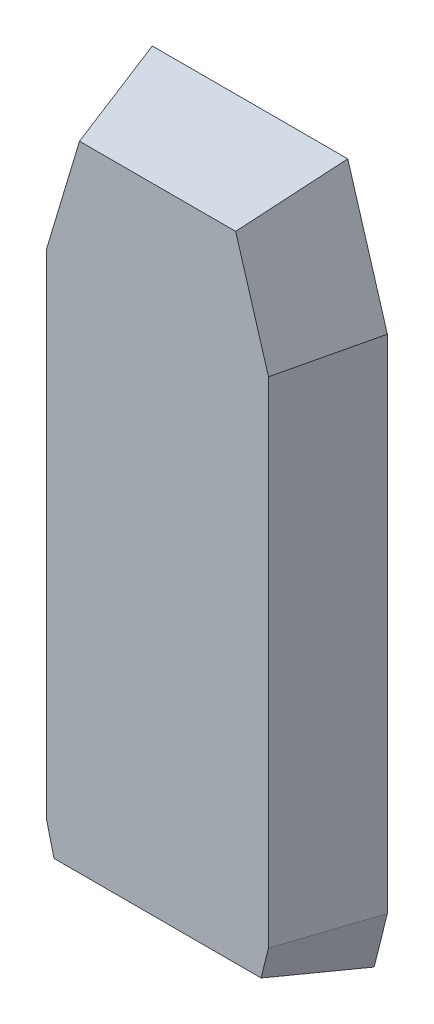
ISO-10303-21;
HEADER;
FILE_DESCRIPTION(('STEP AP214'),'2;1');
FILE_NAME('part.step','',(''),(''),'','','');
FILE_SCHEMA(('AUTOMOTIVE_DESIGN { 1 0 10303 214 1 1 1 1 }'));
ENDSEC;
DATA;
#1=APPLICATION_CONTEXT('core data for automotive mechanical design processes');
#2=APPLICATION_PROTOCOL_DEFINITION('international standard','automotive_design',2000,#1);
#3=PRODUCT_CONTEXT('',#1,'mechanical');
#4=PRODUCT('Part','Part','',(#3));
#5=PRODUCT_RELATED_PRODUCT_CATEGORY('part','',(#4));
#6=PRODUCT_DEFINITION_FORMATION('','',#4);
#7=PRODUCT_DEFINITION_CONTEXT('part definition',#1,'design');
#8=PRODUCT_DEFINITION('design','',#6,#7);
#9=PRODUCT_DEFINITION_SHAPE('','',#8);
#10=(LENGTH_UNIT() NAMED_UNIT(*) SI_UNIT(.MILLI.,.METRE.));
#11=(NAMED_UNIT(*) PLANE_ANGLE_UNIT() SI_UNIT($,.RADIAN.));
#12=(NAMED_UNIT(*) SI_UNIT($,.STERADIAN.) SOLID_ANGLE_UNIT());
#13=UNCERTAINTY_MEASURE_WITH_UNIT(LENGTH_MEASURE(1.E-05),#10,'distance_accuracy_value','');
#14=(GEOMETRIC_REPRESENTATION_CONTEXT(3) GLOBAL_UNCERTAINTY_ASSIGNED_CONTEXT((#13)) GLOBAL_UNIT_ASSIGNED_CONTEXT((#10,
#11,#12)) REPRESENTATION_CONTEXT('',''));
#15=CARTESIAN_POINT('',(0.,0.,0.));
#16=DIRECTION('',(0.,0.,1.));
#17=DIRECTION('',(1.,0.,0.));
#18=AXIS2_PLACEMENT_3D('',#15,#16,#17);
#19=CARTESIAN_POINT('',(0.,0.,70.));
#20=DIRECTION('',(0.,0.,1.));
#21=DIRECTION('',(1.,0.,0.));
#22=AXIS2_PLACEMENT_3D('',#19,#20,#21);
#23=PLANE('',#22);
#24=DIRECTION('',(0.242535625036335,0.970142500145332,0.));
#25=VECTOR('',#24,1.);
#26=CARTESIAN_POINT('',(39.1922359359559,-105.,70.));
#27=LINE('',#26,#25);
#28=CARTESIAN_POINT('',(39.1922359359559,-105.,70.));
#29=VERTEX_POINT('',#28);
#30=CARTESIAN_POINT('',(42.,-93.7689437438237,70.));
#31=VERTEX_POINT('',#30);
#32=EDGE_CURVE('E366',#29,#31,#27,.T.);
#33=ORIENTED_EDGE('',*,*,#32,.T.);
#34=DIRECTION('',(0.,1.,0.));
#35=VECTOR('',#34,1.);
#36=CARTESIAN_POINT('',(42.,-93.7689437438237,70.));
#37=LINE('',#36,#35);
#38=CARTESIAN_POINT('',(42.,93.5323116369648,70.));
#39=VERTEX_POINT('',#38);
#40=EDGE_CURVE('E523',#31,#39,#37,.T.);
#41=ORIENTED_EDGE('',*,*,#40,.T.);
#42=DIRECTION('',(-0.287347885566345,0.957826285221151,0.));
#43=VECTOR('',#42,1.);
#44=CARTESIAN_POINT('',(42.,93.5323116369648,70.));
#45=LINE('',#44,#43);
#46=CARTESIAN_POINT('',(29.5596934910895,135.,70.));
#47=VERTEX_POINT('',#46);
#48=EDGE_CURVE('E518',#39,#47,#45,.T.);
#49=ORIENTED_EDGE('',*,*,#48,.T.);
#50=DIRECTION('',(-1.,0.,0.));
#51=VECTOR('',#50,1.);
#52=CARTESIAN_POINT('',(29.5596934910895,135.,70.));
#53=LINE('',#52,#51);
#54=CARTESIAN_POINT('',(-29.5596934910895,135.,70.));
#55=VERTEX_POINT('',#54);
#56=EDGE_CURVE('E522',#47,#55,#53,.T.);
#57=ORIENTED_EDGE('',*,*,#56,.T.);
#58=DIRECTION('',(-0.287347885566346,-0.957826285221151,0.));
#59=VECTOR('',#58,1.);
#60=CARTESIAN_POINT('',(-29.5596934910895,135.,70.));
#61=LINE('',#60,#59);
#62=CARTESIAN_POINT('',(-41.9999999999999,93.5323116369651,70.));
#63=VERTEX_POINT('',#62);
#64=EDGE_CURVE('E643',#55,#63,#61,.T.);
#65=ORIENTED_EDGE('',*,*,#64,.T.);
#66=DIRECTION('',(0.,-1.,0.));
#67=VECTOR('',#66,1.);
#68=CARTESIAN_POINT('',(-41.9999999999999,93.5323116369651,70.));
#69=LINE('',#68,#67);
#70=CARTESIAN_POINT('',(-42.,-93.7689437438234,70.));
#71=VERTEX_POINT('',#70);
#72=EDGE_CURVE('E595',#63,#71,#69,.T.);
#73=ORIENTED_EDGE('',*,*,#72,.T.);
#74=DIRECTION('',(0.242535625036332,-0.970142500145332,0.));
#75=VECTOR('',#74,1.);
#76=CARTESIAN_POINT('',(-42.,-93.7689437438234,70.));
#77=LINE('',#76,#75);
#78=CARTESIAN_POINT('',(-39.1922359359558,-105.,70.));
#79=VERTEX_POINT('',#78);
#80=EDGE_CURVE('E149',#71,#79,#77,.T.);
#81=ORIENTED_EDGE('',*,*,#80,.T.);
#82=DIRECTION('',(1.,0.,0.));
#83=VECTOR('',#82,1.);
#84=CARTESIAN_POINT('',(-39.1922359359558,-105.,70.));
#85=LINE('',#84,#83);
#86=EDGE_CURVE('E13',#79,#29,#85,.T.);
#87=ORIENTED_EDGE('',*,*,#86,.T.);
#88=EDGE_LOOP('',(#33,#41,#49,#57,#65,#73,#81,#87));
#89=FACE_BOUND('',#88,.T.);
#90=ADVANCED_FACE('F138',(#89),#23,.T.);
#91=CARTESIAN_POINT('',(0.,0.,35.));
#92=DIRECTION('',(0.,0.,1.));
#93=DIRECTION('',(1.,0.,0.));
#94=AXIS2_PLACEMENT_3D('',#91,#92,#93);
#95=PLANE('',#94);
#96=DIRECTION('',(-0.287347885566345,0.957826285221151,0.));
#97=VECTOR('',#96,1.);
#98=CARTESIAN_POINT('',(70.8647478900666,21.25942436702,35.));
#99=LINE('',#98,#97);
#100=CARTESIAN_POINT('',(48.8799529045941,94.5420743185951,35.));
#101=VERTEX_POINT('',#100);
#102=CARTESIAN_POINT('',(34.6785893287944,141.879952904594,35.));
#103=VERTEX_POINT('',#102);
#104=EDGE_CURVE('E325',#101,#103,#99,.T.);
#105=ORIENTED_EDGE('',*,*,#104,.T.);
#106=DIRECTION('',(-1.,0.,0.));
#107=VECTOR('',#106,1.);
#108=CARTESIAN_POINT('',(0.,141.879952904594,35.));
#109=LINE('',#108,#107);
#110=CARTESIAN_POINT('',(-34.6785893287944,141.879952904594,35.));
#111=VERTEX_POINT('',#110);
#112=EDGE_CURVE('E322',#103,#111,#109,.T.);
#113=ORIENTED_EDGE('',*,*,#112,.T.);
#114=DIRECTION('',(-0.287347885566346,-0.957826285221151,0.));
#115=VECTOR('',#114,1.);
#116=CARTESIAN_POINT('',(-70.8647478900667,21.25942436702,35.));
#117=LINE('',#116,#115);
#118=CARTESIAN_POINT('',(-48.879952904594,94.5420743185954,35.));
#119=VERTEX_POINT('',#118);
#120=EDGE_CURVE('E314',#111,#119,#117,.T.);
#121=ORIENTED_EDGE('',*,*,#120,.T.);
#122=DIRECTION('',(0.,-1.,0.));
#123=VECTOR('',#122,1.);
#124=CARTESIAN_POINT('',(-48.879952904594,0.,35.));
#125=LINE('',#124,#123);
#126=CARTESIAN_POINT('',(-48.879952904594,-94.6159046503635,35.));
#127=VERTEX_POINT('',#126);
#128=EDGE_CURVE('E157',#119,#127,#125,.T.);
#129=ORIENTED_EDGE('',*,*,#128,.T.);
#130=DIRECTION('',(0.242535625036332,-0.970142500145332,0.));
#131=VECTOR('',#130,1.);
#132=CARTESIAN_POINT('',(-68.2672273573504,-17.0668068393375,35.));
#133=LINE('',#132,#131);
#134=CARTESIAN_POINT('',(-44.5639408410364,-111.879952904594,35.));
#135=VERTEX_POINT('',#134);
#136=EDGE_CURVE('E315',#127,#135,#133,.T.);
#137=ORIENTED_EDGE('',*,*,#136,.T.);
#138=DIRECTION('',(1.,0.,0.));
#139=VECTOR('',#138,1.);
#140=CARTESIAN_POINT('',(0.,-111.879952904594,35.));
#141=LINE('',#140,#139);
#142=CARTESIAN_POINT('',(44.5639408410364,-111.879952904594,35.));
#143=VERTEX_POINT('',#142);
#144=EDGE_CURVE('E318',#135,#143,#141,.T.);
#145=ORIENTED_EDGE('',*,*,#144,.T.);
#146=DIRECTION('',(0.242535625036335,0.970142500145331,0.));
#147=VECTOR('',#146,1.);
#148=CARTESIAN_POINT('',(68.2672273573507,-17.0668068393378,35.));
#149=LINE('',#148,#147);
#150=CARTESIAN_POINT('',(48.879952904594,-94.6159046503638,35.));
#151=VERTEX_POINT('',#150);
#152=EDGE_CURVE('E329',#143,#151,#149,.T.);
#153=ORIENTED_EDGE('',*,*,#152,.T.);
#154=DIRECTION('',(0.,1.,0.));
#155=VECTOR('',#154,1.);
#156=CARTESIAN_POINT('',(48.879952904594,0.,35.));
#157=LINE('',#156,#155);
#158=EDGE_CURVE('E273',#151,#101,#157,.T.);
#159=ORIENTED_EDGE('',*,*,#158,.T.);
#160=EDGE_LOOP('',(#105,#113,#121,#129,#137,#145,#153,#159));
#161=FACE_BOUND('',#160,.T.);
#162=DIRECTION('',(-1.,0.,0.));
#163=VECTOR('',#162,1.);
#164=CARTESIAN_POINT('',(-37.,145.,35.));
#165=LINE('',#164,#163);
#166=CARTESIAN_POINT('',(37.,145.,35.));
#167=VERTEX_POINT('',#166);
#168=CARTESIAN_POINT('',(-37.,145.,35.));
#169=VERTEX_POINT('',#168);
#170=EDGE_CURVE('E300',#167,#169,#165,.T.);
#171=ORIENTED_EDGE('',*,*,#170,.F.);
#172=DIRECTION('',(-0.287347885566345,0.957826285221151,0.));
#173=VECTOR('',#172,1.);
#174=CARTESIAN_POINT('',(37.,145.,35.));
#175=LINE('',#174,#173);
#176=CARTESIAN_POINT('',(52.,95.,35.));
#177=VERTEX_POINT('',#176);
#178=EDGE_CURVE('E488',#177,#167,#175,.T.);
#179=ORIENTED_EDGE('',*,*,#178,.F.);
#180=DIRECTION('',(0.,1.,0.));
#181=VECTOR('',#180,1.);
#182=CARTESIAN_POINT('',(52.,-95.0000000000003,35.));
#183=LINE('',#182,#181);
#184=CARTESIAN_POINT('',(52.,-95.0000000000003,35.));
#185=VERTEX_POINT('',#184);
#186=EDGE_CURVE('E495',#185,#177,#183,.T.);
#187=ORIENTED_EDGE('',*,*,#186,.F.);
#188=DIRECTION('',(0.242535625036335,0.970142500145331,0.));
#189=VECTOR('',#188,1.);
#190=CARTESIAN_POINT('',(52.,-95.0000000000003,35.));
#191=LINE('',#190,#189);
#192=CARTESIAN_POINT('',(47.,-115.,35.));
#193=VERTEX_POINT('',#192);
#194=EDGE_CURVE('E499',#193,#185,#191,.T.);
#195=ORIENTED_EDGE('',*,*,#194,.F.);
#196=DIRECTION('',(1.,0.,0.));
#197=VECTOR('',#196,1.);
#198=CARTESIAN_POINT('',(47.,-115.,35.));
#199=LINE('',#198,#197);
#200=CARTESIAN_POINT('',(-47.,-115.,35.));
#201=VERTEX_POINT('',#200);
#202=EDGE_CURVE('E584',#201,#193,#199,.T.);
#203=ORIENTED_EDGE('',*,*,#202,.F.);
#204=DIRECTION('',(0.242535625036332,-0.970142500145332,0.));
#205=VECTOR('',#204,1.);
#206=CARTESIAN_POINT('',(-47.,-115.,35.));
#207=LINE('',#206,#205);
#208=CARTESIAN_POINT('',(-52.,-95.,35.));
#209=VERTEX_POINT('',#208);
#210=EDGE_CURVE('E738',#209,#201,#207,.T.);
#211=ORIENTED_EDGE('',*,*,#210,.F.);
#212=DIRECTION('',(0.,-1.,0.));
#213=VECTOR('',#212,1.);
#214=CARTESIAN_POINT('',(-52.,-95.,35.));
#215=LINE('',#214,#213);
#216=CARTESIAN_POINT('',(-51.9999999999999,95.0000000000003,35.));
#217=VERTEX_POINT('',#216);
#218=EDGE_CURVE('E422',#217,#209,#215,.T.);
#219=ORIENTED_EDGE('',*,*,#218,.F.);
#220=DIRECTION('',(-0.287347885566346,-0.957826285221151,0.));
#221=VECTOR('',#220,1.);
#222=CARTESIAN_POINT('',(-51.9999999999999,95.0000000000003,35.));
#223=LINE('',#222,#221);
#224=EDGE_CURVE('E378',#169,#217,#223,.T.);
#225=ORIENTED_EDGE('',*,*,#224,.F.);
#226=EDGE_LOOP('',(#171,#179,#187,#195,#203,#211,#219,#225));
#227=FACE_BOUND('',#226,.T.);
#228=ADVANCED_FACE('F434',(#161,#227),#95,.F.);
#229=CARTESIAN_POINT('',(-52.,-95.,35.));
#230=DIRECTION('',(-0.932815246513878,-0.233203811628468,0.274721127897378));
#231=DIRECTION('',(0.242535625036332,-0.970142500145332,0.));
#232=AXIS2_PLACEMENT_3D('',#229,#230,#231);
#233=PLANE('',#232);
#234=ORIENTED_EDGE('',*,*,#210,.T.);
#235=CARTESIAN_POINT('',(-47.,-115.,35.));
#236=CARTESIAN_POINT('',(-44.397411978652,-111.666666666667,46.6666666666667));
#237=CARTESIAN_POINT('',(-41.7948239573039,-108.333333333333,58.3333333333333));
#238=CARTESIAN_POINT('',(-39.1922359359558,-105.,70.));
#239=B_SPLINE_CURVE_WITH_KNOTS('',3,(#235,#236,#237,#238),.UNSPECIFIED.,.F.,.F.,(4,4),(0.,1.),.UNSPECIFIED.);
#240=EDGE_CURVE('E357',#201,#79,#239,.T.);
#241=ORIENTED_EDGE('',*,*,#240,.T.);
#242=ORIENTED_EDGE('',*,*,#80,.F.);
#243=CARTESIAN_POINT('',(-52.,-95.,35.));
#244=CARTESIAN_POINT('',(-48.6666666666666,-94.5896479146078,46.6666666666667));
#245=CARTESIAN_POINT('',(-45.3333333333333,-94.1792958292156,58.3333333333333));
#246=CARTESIAN_POINT('',(-42.,-93.7689437438234,70.));
#247=B_SPLINE_CURVE_WITH_KNOTS('',3,(#243,#244,#245,#246),.UNSPECIFIED.,.F.,.F.,(4,4),(0.,1.),.UNSPECIFIED.);
#248=EDGE_CURVE('E347',#209,#71,#247,.T.);
#249=ORIENTED_EDGE('',*,*,#248,.F.);
#250=EDGE_LOOP('',(#234,#241,#242,#249));
#251=FACE_BOUND('',#250,.T.);
#252=ADVANCED_FACE('F444',(#251),#233,.T.);
#253=CARTESIAN_POINT('',(-51.9999999999999,95.0000000000003,35.));
#254=DIRECTION('',(-0.961523947640823,0.,0.274721127897378));
#255=DIRECTION('',(0.,-1.,0.));
#256=AXIS2_PLACEMENT_3D('',#253,#254,#255);
#257=PLANE('',#256);
#258=ORIENTED_EDGE('',*,*,#218,.T.);
#259=ORIENTED_EDGE('',*,*,#248,.T.);
#260=ORIENTED_EDGE('',*,*,#72,.F.);
#261=CARTESIAN_POINT('',(-51.9999999999999,95.0000000000003,35.));
#262=CARTESIAN_POINT('',(-48.6666666666666,94.5107705456552,46.6666666666667));
#263=CARTESIAN_POINT('',(-45.3333333333333,94.0215410913102,58.3333333333333));
#264=CARTESIAN_POINT('',(-41.9999999999999,93.5323116369651,70.));
#265=B_SPLINE_CURVE_WITH_KNOTS('',3,(#261,#262,#263,#264),.UNSPECIFIED.,.F.,.F.,(4,4),(0.,1.),.UNSPECIFIED.);
#266=EDGE_CURVE('E336',#217,#63,#265,.T.);
#267=ORIENTED_EDGE('',*,*,#266,.F.);
#268=EDGE_LOOP('',(#258,#259,#260,#267));
#269=FACE_BOUND('',#268,.T.);
#270=ADVANCED_FACE('F687',(#269),#257,.T.);
#271=CARTESIAN_POINT('',(-37.,145.,35.));
#272=DIRECTION('',(-0.920972910919986,0.276291873275996,0.274721127897378));
#273=DIRECTION('',(-0.287347885566346,-0.957826285221151,0.));
#274=AXIS2_PLACEMENT_3D('',#271,#272,#273);
#275=PLANE('',#274);
#276=ORIENTED_EDGE('',*,*,#224,.T.);
#277=ORIENTED_EDGE('',*,*,#266,.T.);
#278=ORIENTED_EDGE('',*,*,#64,.F.);
#279=CARTESIAN_POINT('',(-37.,145.,35.));
#280=CARTESIAN_POINT('',(-34.5198978303632,141.666666666667,46.6666666666667));
#281=CARTESIAN_POINT('',(-32.0397956607263,138.333333333333,58.3333333333333));
#282=CARTESIAN_POINT('',(-29.5596934910895,135.,70.));
#283=B_SPLINE_CURVE_WITH_KNOTS('',3,(#279,#280,#281,#282),.UNSPECIFIED.,.F.,.F.,(4,4),(0.,1.),.UNSPECIFIED.);
#284=EDGE_CURVE('E333',#169,#55,#283,.T.);
#285=ORIENTED_EDGE('',*,*,#284,.F.);
#286=EDGE_LOOP('',(#276,#277,#278,#285));
#287=FACE_BOUND('',#286,.T.);
#288=ADVANCED_FACE('F678',(#287),#275,.T.);
#289=CARTESIAN_POINT('',(37.,145.,35.));
#290=DIRECTION('',(0.,0.961523947640823,0.274721127897378));
#291=DIRECTION('',(-1.,0.,0.));
#292=AXIS2_PLACEMENT_3D('',#289,#290,#291);
#293=PLANE('',#292);
#294=ORIENTED_EDGE('',*,*,#170,.T.);
#295=ORIENTED_EDGE('',*,*,#284,.T.);
#296=ORIENTED_EDGE('',*,*,#56,.F.);
#297=CARTESIAN_POINT('',(37.,145.,35.));
#298=CARTESIAN_POINT('',(34.5198978303632,141.666666666667,46.6666666666667));
#299=CARTESIAN_POINT('',(32.0397956607263,138.333333333333,58.3333333333333));
#300=CARTESIAN_POINT('',(29.5596934910895,135.,70.));
#301=B_SPLINE_CURVE_WITH_KNOTS('',3,(#297,#298,#299,#300),.UNSPECIFIED.,.F.,.F.,(4,4),(0.,1.),.UNSPECIFIED.);
#302=EDGE_CURVE('E337',#167,#47,#301,.T.);
#303=ORIENTED_EDGE('',*,*,#302,.F.);
#304=EDGE_LOOP('',(#294,#295,#296,#303));
#305=FACE_BOUND('',#304,.T.);
#306=ADVANCED_FACE('F540',(#305),#293,.T.);
#307=CARTESIAN_POINT('',(52.,95.,35.));
#308=DIRECTION('',(0.920972910919987,0.276291873275996,0.274721127897378));
#309=DIRECTION('',(-0.287347885566345,0.957826285221152,0.));
#310=AXIS2_PLACEMENT_3D('',#307,#308,#309);
#311=PLANE('',#310);
#312=ORIENTED_EDGE('',*,*,#178,.T.);
#313=ORIENTED_EDGE('',*,*,#302,.T.);
#314=ORIENTED_EDGE('',*,*,#48,.F.);
#315=CARTESIAN_POINT('',(52.,95.,35.));
#316=CARTESIAN_POINT('',(48.6666666666667,94.510770545655,46.6666666666667));
#317=CARTESIAN_POINT('',(45.3333333333333,94.0215410913099,58.3333333333333));
#318=CARTESIAN_POINT('',(42.,93.5323116369648,70.));
#319=B_SPLINE_CURVE_WITH_KNOTS('',3,(#315,#316,#317,#318),.UNSPECIFIED.,.F.,.F.,(4,4),(0.,1.),.UNSPECIFIED.);
#320=EDGE_CURVE('E388',#177,#39,#319,.T.);
#321=ORIENTED_EDGE('',*,*,#320,.F.);
#322=EDGE_LOOP('',(#312,#313,#314,#321));
#323=FACE_BOUND('',#322,.T.);
#324=ADVANCED_FACE('F514',(#323),#311,.T.);
#325=CARTESIAN_POINT('',(52.,-95.0000000000003,35.));
#326=DIRECTION('',(0.961523947640823,0.,0.274721127897378));
#327=DIRECTION('',(0.,1.,0.));
#328=AXIS2_PLACEMENT_3D('',#325,#326,#327);
#329=PLANE('',#328);
#330=ORIENTED_EDGE('',*,*,#186,.T.);
#331=ORIENTED_EDGE('',*,*,#320,.T.);
#332=ORIENTED_EDGE('',*,*,#40,.F.);
#333=CARTESIAN_POINT('',(52.,-95.0000000000003,35.));
#334=CARTESIAN_POINT('',(48.6666666666666,-94.5896479146081,46.6666666666667));
#335=CARTESIAN_POINT('',(45.3333333333333,-94.1792958292159,58.3333333333333));
#336=CARTESIAN_POINT('',(42.,-93.7689437438237,70.));
#337=B_SPLINE_CURVE_WITH_KNOTS('',3,(#333,#334,#335,#336),.UNSPECIFIED.,.F.,.F.,(4,4),(0.,1.),.UNSPECIFIED.);
#338=EDGE_CURVE('E377',#185,#31,#337,.T.);
#339=ORIENTED_EDGE('',*,*,#338,.F.);
#340=EDGE_LOOP('',(#330,#331,#332,#339));
#341=FACE_BOUND('',#340,.T.);
#342=ADVANCED_FACE('F509',(#341),#329,.T.);
#343=CARTESIAN_POINT('',(47.,-115.,35.));
#344=DIRECTION('',(0.932815246513877,-0.233203811628471,0.274721127897378));
#345=DIRECTION('',(0.242535625036335,0.970142500145331,0.));
#346=AXIS2_PLACEMENT_3D('',#343,#344,#345);
#347=PLANE('',#346);
#348=ORIENTED_EDGE('',*,*,#194,.T.);
#349=ORIENTED_EDGE('',*,*,#338,.T.);
#350=ORIENTED_EDGE('',*,*,#32,.F.);
#351=CARTESIAN_POINT('',(47.,-115.,35.));
#352=CARTESIAN_POINT('',(44.397411978652,-111.666666666667,46.6666666666667));
#353=CARTESIAN_POINT('',(41.7948239573039,-108.333333333333,58.3333333333333));
#354=CARTESIAN_POINT('',(39.1922359359559,-105.,70.));
#355=B_SPLINE_CURVE_WITH_KNOTS('',3,(#351,#352,#353,#354),.UNSPECIFIED.,.F.,.F.,(4,4),(0.,1.),.UNSPECIFIED.);
#356=EDGE_CURVE('E371',#193,#29,#355,.T.);
#357=ORIENTED_EDGE('',*,*,#356,.F.);
#358=EDGE_LOOP('',(#348,#349,#350,#357));
#359=FACE_BOUND('',#358,.T.);
#360=ADVANCED_FACE('F546',(#359),#347,.T.);
#361=CARTESIAN_POINT('',(-47.,-115.,35.));
#362=DIRECTION('',(0.,-0.961523947640823,0.274721127897378));
#363=DIRECTION('',(1.,0.,0.));
#364=AXIS2_PLACEMENT_3D('',#361,#362,#363);
#365=PLANE('',#364);
#366=ORIENTED_EDGE('',*,*,#202,.T.);
#367=ORIENTED_EDGE('',*,*,#356,.T.);
#368=ORIENTED_EDGE('',*,*,#86,.F.);
#369=ORIENTED_EDGE('',*,*,#240,.F.);
#370=EDGE_LOOP('',(#366,#367,#368,#369));
#371=FACE_BOUND('',#370,.T.);
#372=ADVANCED_FACE('F140',(#371),#365,.T.);
#373=CARTESIAN_POINT('',(0.,0.,67.));
#374=DIRECTION('',(0.,0.,1.));
#375=DIRECTION('',(1.,0.,0.));
#376=AXIS2_PLACEMENT_3D('',#373,#374,#375);
#377=PLANE('',#376);
#378=DIRECTION('',(0.242535625036335,0.970142500145331,0.));
#379=VECTOR('',#378,1.);
#380=CARTESIAN_POINT('',(59.3973530703077,-14.849338267577,67.));
#381=LINE('',#380,#379);
#382=CARTESIAN_POINT('',(37.4254136967675,-102.737095761737,67.));
#383=VERTEX_POINT('',#382);
#384=CARTESIAN_POINT('',(39.7370957617369,-93.4903675018594,67.));
#385=VERTEX_POINT('',#384);
#386=EDGE_CURVE('E262',#383,#385,#381,.T.);
#387=ORIENTED_EDGE('',*,*,#386,.F.);
#388=DIRECTION('',(1.,0.,0.));
#389=VECTOR('',#388,1.);
#390=CARTESIAN_POINT('',(0.,-102.737095761737,67.));
#391=LINE('',#390,#389);
#392=CARTESIAN_POINT('',(-37.4254136967675,-102.737095761737,67.));
#393=VERTEX_POINT('',#392);
#394=EDGE_CURVE('E299',#393,#383,#391,.T.);
#395=ORIENTED_EDGE('',*,*,#394,.F.);
#396=DIRECTION('',(0.242535625036332,-0.970142500145332,0.));
#397=VECTOR('',#396,1.);
#398=CARTESIAN_POINT('',(-59.3973530703074,-14.8493382675768,67.));
#399=LINE('',#398,#397);
#400=CARTESIAN_POINT('',(-39.7370957617369,-93.4903675018592,67.));
#401=VERTEX_POINT('',#400);
#402=EDGE_CURVE('E296',#401,#393,#399,.T.);
#403=ORIENTED_EDGE('',*,*,#402,.F.);
#404=DIRECTION('',(0.,-1.,0.));
#405=VECTOR('',#404,1.);
#406=CARTESIAN_POINT('',(-39.7370957617369,0.,67.));
#407=LINE('',#406,#405);
#408=CARTESIAN_POINT('',(-39.7370957617368,93.200187815249,67.));
#409=VERTEX_POINT('',#408);
#410=EDGE_CURVE('E293',#409,#401,#407,.T.);
#411=ORIENTED_EDGE('',*,*,#410,.F.);
#412=DIRECTION('',(-0.287347885566346,-0.957826285221151,0.));
#413=VECTOR('',#412,1.);
#414=CARTESIAN_POINT('',(-62.1074789966161,18.6322436989849,67.));
#415=LINE('',#414,#413);
#416=CARTESIAN_POINT('',(-27.8760233777904,132.737095761737,67.));
#417=VERTEX_POINT('',#416);
#418=EDGE_CURVE('E290',#417,#409,#415,.T.);
#419=ORIENTED_EDGE('',*,*,#418,.F.);
#420=DIRECTION('',(-1.,0.,0.));
#421=VECTOR('',#420,1.);
#422=CARTESIAN_POINT('',(0.,132.737095761737,67.));
#423=LINE('',#422,#421);
#424=CARTESIAN_POINT('',(27.8760233777905,132.737095761737,67.));
#425=VERTEX_POINT('',#424);
#426=EDGE_CURVE('E287',#425,#417,#423,.T.);
#427=ORIENTED_EDGE('',*,*,#426,.F.);
#428=DIRECTION('',(-0.287347885566345,0.957826285221151,0.));
#429=VECTOR('',#428,1.);
#430=CARTESIAN_POINT('',(62.1074789966161,18.6322436989848,67.));
#431=LINE('',#430,#429);
#432=CARTESIAN_POINT('',(39.7370957617369,93.2001878152487,67.));
#433=VERTEX_POINT('',#432);
#434=EDGE_CURVE('E265',#433,#425,#431,.T.);
#435=ORIENTED_EDGE('',*,*,#434,.F.);
#436=DIRECTION('',(0.,1.,0.));
#437=VECTOR('',#436,1.);
#438=CARTESIAN_POINT('',(39.7370957617369,0.,67.));
#439=LINE('',#438,#437);
#440=EDGE_CURVE('E257',#385,#433,#439,.T.);
#441=ORIENTED_EDGE('',*,*,#440,.F.);
#442=EDGE_LOOP('',(#387,#395,#403,#411,#419,#427,#435,#441));
#443=FACE_BOUND('',#442,.T.);
#444=ADVANCED_FACE('F259',(#443),#377,.F.);
#445=CARTESIAN_POINT('',(-49.2015542604584,-94.3003885651146,34.1758366163079));
#446=DIRECTION('',(-0.932815246513878,-0.233203811628468,0.274721127897378));
#447=DIRECTION('',(0.242535625036332,-0.970142500145332,0.));
#448=AXIS2_PLACEMENT_3D('',#445,#446,#447);
#449=PLANE('',#448);
#450=ORIENTED_EDGE('',*,*,#136,.F.);
#451=DIRECTION('',(0.274564153208707,0.0338003918529405,0.960974536230474));
#452=VECTOR('',#451,1.);
#453=CARTESIAN_POINT('',(-47.3554522499716,-94.4282300435217,40.3357522911786));
#454=LINE('',#453,#452);
#455=EDGE_CURVE('E283',#127,#401,#454,.T.);
#456=ORIENTED_EDGE('',*,*,#455,.T.);
#457=ORIENTED_EDGE('',*,*,#402,.T.);
#458=DIRECTION('',(0.209725456459051,0.268611416455148,0.940139957593018));
#459=VECTOR('',#458,1.);
#460=CARTESIAN_POINT('',(-43.9400878997779,-111.080936776364,37.7965564488049));
#461=LINE('',#460,#459);
#462=EDGE_CURVE('E281',#135,#393,#461,.T.);
#463=ORIENTED_EDGE('',*,*,#462,.F.);
#464=EDGE_LOOP('',(#450,#456,#457,#463));
#465=FACE_BOUND('',#464,.T.);
#466=ADVANCED_FACE('F816',(#465),#449,.F.);
#467=CARTESIAN_POINT('',(-49.1154281570775,95.0000000000003,34.1758366163079));
#468=DIRECTION('',(-0.961523947640823,0.,0.274721127897378));
#469=DIRECTION('',(0.,-1.,0.));
#470=AXIS2_PLACEMENT_3D('',#467,#468,#469);
#471=PLANE('',#470);
#472=ORIENTED_EDGE('',*,*,#128,.F.);
#473=DIRECTION('',(0.274498086876402,-0.0402877647783909,0.960743304067406));
#474=VECTOR('',#473,1.);
#475=CARTESIAN_POINT('',(-48.5428178394752,94.4925933974108,36.1799727279156));
#476=LINE('',#475,#474);
#477=EDGE_CURVE('E304',#119,#409,#476,.T.);
#478=ORIENTED_EDGE('',*,*,#477,.T.);
#479=ORIENTED_EDGE('',*,*,#410,.T.);
#480=ORIENTED_EDGE('',*,*,#455,.F.);
#481=EDGE_LOOP('',(#472,#478,#479,#480));
#482=FACE_BOUND('',#481,.T.);
#483=ADVANCED_FACE('F822',(#482),#471,.F.);
#484=CARTESIAN_POINT('',(-34.23708126724,144.171124380172,34.1758366163079));
#485=DIRECTION('',(-0.920972910919986,0.276291873275996,0.274721127897378));
#486=DIRECTION('',(-0.287347885566346,-0.957826285221151,0.));
#487=AXIS2_PLACEMENT_3D('',#484,#485,#486);
#488=PLANE('',#487);
#489=ORIENTED_EDGE('',*,*,#120,.F.);
#490=DIRECTION('',(0.200260332719355,-0.269156025332454,0.94204608866359));
#491=VECTOR('',#490,1.);
#492=CARTESIAN_POINT('',(-31.9721513020131,138.242417241863,47.7313748195589));
#493=LINE('',#492,#491);
#494=EDGE_CURVE('E306',#111,#417,#493,.T.);
#495=ORIENTED_EDGE('',*,*,#494,.T.);
#496=ORIENTED_EDGE('',*,*,#418,.T.);
#497=ORIENTED_EDGE('',*,*,#477,.F.);
#498=EDGE_LOOP('',(#489,#495,#496,#497));
#499=FACE_BOUND('',#498,.T.);
#500=ADVANCED_FACE('F830',(#499),#488,.F.);
#501=CARTESIAN_POINT('',(37.,142.115428157078,34.1758366163079));
#502=DIRECTION('',(0.,0.961523947640823,0.274721127897378));
#503=DIRECTION('',(-1.,0.,0.));
#504=AXIS2_PLACEMENT_3D('',#501,#502,#503);
#505=PLANE('',#504);
#506=ORIENTED_EDGE('',*,*,#112,.F.);
#507=DIRECTION('',(-0.200260332719355,-0.269156025332454,0.94204608866359));
#508=VECTOR('',#507,1.);
#509=CARTESIAN_POINT('',(32.8463614193055,139.417382434823,43.6189966441991));
#510=LINE('',#509,#508);
#511=EDGE_CURVE('E309',#103,#425,#510,.T.);
#512=ORIENTED_EDGE('',*,*,#511,.T.);
#513=ORIENTED_EDGE('',*,*,#426,.T.);
#514=ORIENTED_EDGE('',*,*,#494,.F.);
#515=EDGE_LOOP('',(#506,#512,#513,#514));
#516=FACE_BOUND('',#515,.T.);
#517=ADVANCED_FACE('F837',(#516),#505,.F.);
#518=CARTESIAN_POINT('',(49.23708126724,94.171124380172,34.1758366163079));
#519=DIRECTION('',(0.920972910919987,0.276291873275996,0.274721127897378));
#520=DIRECTION('',(-0.287347885566345,0.957826285221152,0.));
#521=AXIS2_PLACEMENT_3D('',#518,#519,#520);
#522=PLANE('',#521);
#523=ORIENTED_EDGE('',*,*,#104,.F.);
#524=DIRECTION('',(-0.274498086876402,-0.0402877647783906,0.960743304067406));
#525=VECTOR('',#524,1.);
#526=CARTESIAN_POINT('',(47.0189163894706,94.2689321549521,41.513627802932));
#527=LINE('',#526,#525);
#528=EDGE_CURVE('E277',#101,#433,#527,.T.);
#529=ORIENTED_EDGE('',*,*,#528,.T.);
#530=ORIENTED_EDGE('',*,*,#434,.T.);
#531=ORIENTED_EDGE('',*,*,#511,.F.);
#532=EDGE_LOOP('',(#523,#529,#530,#531));
#533=FACE_BOUND('',#532,.T.);
#534=ADVANCED_FACE('F845',(#533),#522,.F.);
#535=CARTESIAN_POINT('',(49.1154281570775,-95.0000000000003,34.1758366163079));
#536=DIRECTION('',(0.961523947640823,0.,0.274721127897378));
#537=DIRECTION('',(0.,1.,0.));
#538=AXIS2_PLACEMENT_3D('',#535,#536,#537);
#539=PLANE('',#538);
#540=ORIENTED_EDGE('',*,*,#158,.F.);
#541=DIRECTION('',(-0.274564153208707,0.0338003918529409,0.960974536230473));
#542=VECTOR('',#541,1.);
#543=CARTESIAN_POINT('',(48.9274038319528,-94.6217461264624,34.8339217542444));
#544=LINE('',#543,#542);
#545=EDGE_CURVE('E270',#151,#385,#544,.T.);
#546=ORIENTED_EDGE('',*,*,#545,.T.);
#547=ORIENTED_EDGE('',*,*,#440,.T.);
#548=ORIENTED_EDGE('',*,*,#528,.F.);
#549=EDGE_LOOP('',(#540,#546,#547,#548));
#550=FACE_BOUND('',#549,.T.);
#551=ADVANCED_FACE('F271',(#550),#539,.F.);
#552=CARTESIAN_POINT('',(44.2015542604584,-114.300388565115,34.1758366163079));
#553=DIRECTION('',(0.932815246513877,-0.233203811628471,0.274721127897378));
#554=DIRECTION('',(0.242535625036335,0.970142500145331,0.));
#555=AXIS2_PLACEMENT_3D('',#552,#553,#554);
#556=PLANE('',#555);
#557=ORIENTED_EDGE('',*,*,#152,.F.);
#558=DIRECTION('',(-0.20972545645905,0.268611416455148,0.940139957593018));
#559=VECTOR('',#558,1.);
#560=CARTESIAN_POINT('',(40.7122889966925,-106.946848096674,52.2658668277192));
#561=LINE('',#560,#559);
#562=EDGE_CURVE('E278',#143,#383,#561,.T.);
#563=ORIENTED_EDGE('',*,*,#562,.T.);
#564=ORIENTED_EDGE('',*,*,#386,.T.);
#565=ORIENTED_EDGE('',*,*,#545,.F.);
#566=EDGE_LOOP('',(#557,#563,#564,#565));
#567=FACE_BOUND('',#566,.T.);
#568=ADVANCED_FACE('F280',(#567),#556,.F.);
#569=CARTESIAN_POINT('',(-47.,-112.115428157078,34.1758366163079));
#570=DIRECTION('',(0.,-0.961523947640823,0.274721127897378));
#571=DIRECTION('',(1.,0.,0.));
#572=AXIS2_PLACEMENT_3D('',#569,#570,#571);
#573=PLANE('',#572);
#574=ORIENTED_EDGE('',*,*,#144,.F.);
#575=ORIENTED_EDGE('',*,*,#462,.T.);
#576=ORIENTED_EDGE('',*,*,#394,.T.);
#577=ORIENTED_EDGE('',*,*,#562,.F.);
#578=EDGE_LOOP('',(#574,#575,#576,#577));
#579=FACE_BOUND('',#578,.T.);
#580=ADVANCED_FACE('F446',(#579),#573,.F.);
#581=CLOSED_SHELL('',(#90,#228,#252,#270,#288,#306,#324,#342,#360,#372,#444,#466,#483,#500,#517,
#534,#551,#568,#580));
#582=MANIFOLD_SOLID_BREP('B2',#581);
#583=ADVANCED_BREP_SHAPE_REPRESENTATION('',(#18,#582),#14);
#584=SHAPE_DEFINITION_REPRESENTATION(#9,#583);
ENDSEC;
END-ISO-10303-21;
